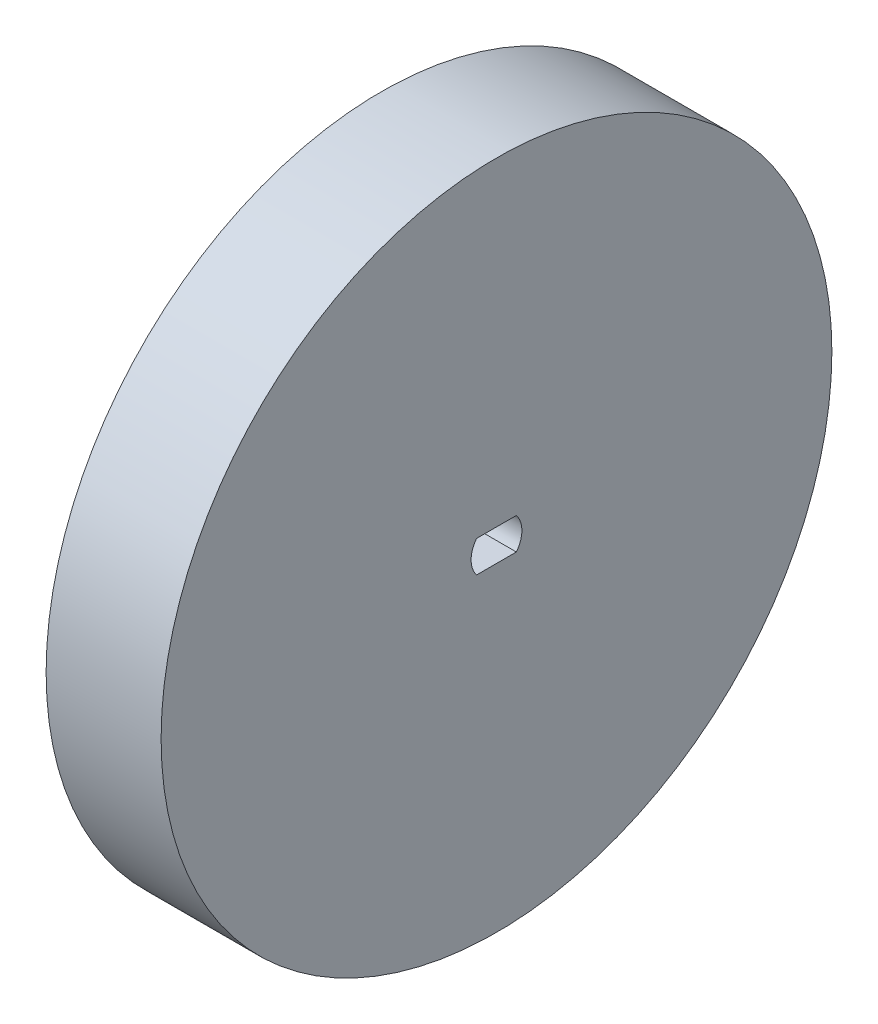
ISO-10303-21;
HEADER;
FILE_DESCRIPTION(('STEP AP214'),'2;1');
FILE_NAME('part.step','',(''),(''),'','','');
FILE_SCHEMA(('AUTOMOTIVE_DESIGN { 1 0 10303 214 1 1 1 1 }'));
ENDSEC;
DATA;
#1=APPLICATION_CONTEXT('core data for automotive mechanical design processes');
#2=APPLICATION_PROTOCOL_DEFINITION('international standard','automotive_design',2000,#1);
#3=PRODUCT_CONTEXT('',#1,'mechanical');
#4=PRODUCT('Part','Part','',(#3));
#5=PRODUCT_RELATED_PRODUCT_CATEGORY('part','',(#4));
#6=PRODUCT_DEFINITION_FORMATION('','',#4);
#7=PRODUCT_DEFINITION_CONTEXT('part definition',#1,'design');
#8=PRODUCT_DEFINITION('design','',#6,#7);
#9=PRODUCT_DEFINITION_SHAPE('','',#8);
#10=(LENGTH_UNIT() NAMED_UNIT(*) SI_UNIT(.MILLI.,.METRE.));
#11=(NAMED_UNIT(*) PLANE_ANGLE_UNIT() SI_UNIT($,.RADIAN.));
#12=(NAMED_UNIT(*) SI_UNIT($,.STERADIAN.) SOLID_ANGLE_UNIT());
#13=UNCERTAINTY_MEASURE_WITH_UNIT(LENGTH_MEASURE(1.E-05),#10,'distance_accuracy_value','');
#14=(GEOMETRIC_REPRESENTATION_CONTEXT(3) GLOBAL_UNCERTAINTY_ASSIGNED_CONTEXT((#13)) GLOBAL_UNIT_ASSIGNED_CONTEXT((#10,
#11,#12)) REPRESENTATION_CONTEXT('',''));
#15=CARTESIAN_POINT('',(0.,0.,0.));
#16=DIRECTION('',(0.,0.,1.));
#17=DIRECTION('',(1.,0.,0.));
#18=AXIS2_PLACEMENT_3D('',#15,#16,#17);
#19=CARTESIAN_POINT('',(-12.,0.,0.));
#20=DIRECTION('',(1.,0.,0.));
#21=DIRECTION('',(0.,0.,-1.));
#22=AXIS2_PLACEMENT_3D('',#19,#20,#21);
#23=CYLINDRICAL_SURFACE('',#22,2.65);
#24=CARTESIAN_POINT('',(0.,0.,0.));
#25=DIRECTION('',(1.,0.,0.));
#26=DIRECTION('',(0.,0.,-1.));
#27=AXIS2_PLACEMENT_3D('',#24,#25,#26);
#28=CIRCLE('',#27,2.65);
#29=CARTESIAN_POINT('',(0.,-1.65,-2.07364413533277));
#30=VERTEX_POINT('',#29);
#31=CARTESIAN_POINT('',(0.,1.65,-2.07364413533278));
#32=VERTEX_POINT('',#31);
#33=EDGE_CURVE('E104',#30,#32,#28,.T.);
#34=ORIENTED_EDGE('',*,*,#33,.T.);
#35=DIRECTION('',(1.,0.,0.));
#36=VECTOR('',#35,1.);
#37=CARTESIAN_POINT('',(-12.,1.65,-2.07364413533278));
#38=LINE('',#37,#36);
#39=CARTESIAN_POINT('',(-12.,1.65,-2.07364413533278));
#40=VERTEX_POINT('',#39);
#41=EDGE_CURVE('E11',#40,#32,#38,.T.);
#42=ORIENTED_EDGE('',*,*,#41,.F.);
#43=CARTESIAN_POINT('',(-12.,0.,0.));
#44=DIRECTION('',(1.,0.,0.));
#45=DIRECTION('',(0.,0.,-1.));
#46=AXIS2_PLACEMENT_3D('',#43,#44,#45);
#47=CIRCLE('',#46,2.65);
#48=CARTESIAN_POINT('',(-12.,-1.65,-2.07364413533277));
#49=VERTEX_POINT('',#48);
#50=EDGE_CURVE('E57',#49,#40,#47,.T.);
#51=ORIENTED_EDGE('',*,*,#50,.F.);
#52=DIRECTION('',(1.,0.,0.));
#53=VECTOR('',#52,1.);
#54=CARTESIAN_POINT('',(-12.,-1.65,-2.07364413533277));
#55=LINE('',#54,#53);
#56=EDGE_CURVE('E42',#49,#30,#55,.T.);
#57=ORIENTED_EDGE('',*,*,#56,.T.);
#58=EDGE_LOOP('',(#34,#42,#51,#57));
#59=FACE_BOUND('',#58,.T.);
#60=ADVANCED_FACE('F38',(#59),#23,.F.);
#61=CARTESIAN_POINT('',(-12.,1.65,0.));
#62=DIRECTION('',(0.,-1.,0.));
#63=DIRECTION('',(0.,0.,-1.));
#64=AXIS2_PLACEMENT_3D('',#61,#62,#63);
#65=PLANE('',#64);
#66=DIRECTION('',(0.,0.,-1.));
#67=VECTOR('',#66,1.);
#68=CARTESIAN_POINT('',(0.,1.65,0.));
#69=LINE('',#68,#67);
#70=CARTESIAN_POINT('',(0.,1.65,2.07364413533278));
#71=VERTEX_POINT('',#70);
#72=EDGE_CURVE('E108',#71,#32,#69,.T.);
#73=ORIENTED_EDGE('',*,*,#72,.F.);
#74=DIRECTION('',(1.,0.,0.));
#75=VECTOR('',#74,1.);
#76=CARTESIAN_POINT('',(-12.,1.65,2.07364413533278));
#77=LINE('',#76,#75);
#78=CARTESIAN_POINT('',(-12.,1.65,2.07364413533278));
#79=VERTEX_POINT('',#78);
#80=EDGE_CURVE('E48',#79,#71,#77,.T.);
#81=ORIENTED_EDGE('',*,*,#80,.F.);
#82=DIRECTION('',(0.,0.,-1.));
#83=VECTOR('',#82,1.);
#84=CARTESIAN_POINT('',(-12.,1.65,0.));
#85=LINE('',#84,#83);
#86=EDGE_CURVE('E88',#79,#40,#85,.T.);
#87=ORIENTED_EDGE('',*,*,#86,.T.);
#88=ORIENTED_EDGE('',*,*,#41,.T.);
#89=EDGE_LOOP('',(#73,#81,#87,#88));
#90=FACE_BOUND('',#89,.T.);
#91=ADVANCED_FACE('F129',(#90),#65,.T.);
#92=CARTESIAN_POINT('',(0.,-1.65,2.07364413533277));
#93=VERTEX_POINT('',#92);
#94=EDGE_CURVE('E93',#71,#93,#28,.T.);
#95=ORIENTED_EDGE('',*,*,#94,.T.);
#96=DIRECTION('',(1.,0.,0.));
#97=VECTOR('',#96,1.);
#98=CARTESIAN_POINT('',(-12.,-1.65,2.07364413533277));
#99=LINE('',#98,#97);
#100=CARTESIAN_POINT('',(-12.,-1.65,2.07364413533277));
#101=VERTEX_POINT('',#100);
#102=EDGE_CURVE('E91',#101,#93,#99,.T.);
#103=ORIENTED_EDGE('',*,*,#102,.F.);
#104=EDGE_CURVE('E84',#79,#101,#47,.T.);
#105=ORIENTED_EDGE('',*,*,#104,.F.);
#106=ORIENTED_EDGE('',*,*,#80,.T.);
#107=EDGE_LOOP('',(#95,#103,#105,#106));
#108=FACE_BOUND('',#107,.T.);
#109=ADVANCED_FACE('F92',(#108),#23,.F.);
#110=CARTESIAN_POINT('',(-12.,-1.65,0.));
#111=DIRECTION('',(0.,-1.,0.));
#112=DIRECTION('',(0.,0.,-1.));
#113=AXIS2_PLACEMENT_3D('',#110,#111,#112);
#114=PLANE('',#113);
#115=DIRECTION('',(0.,0.,-1.));
#116=VECTOR('',#115,1.);
#117=CARTESIAN_POINT('',(0.,-1.65,0.));
#118=LINE('',#117,#116);
#119=EDGE_CURVE('E106',#93,#30,#118,.T.);
#120=ORIENTED_EDGE('',*,*,#119,.T.);
#121=ORIENTED_EDGE('',*,*,#56,.F.);
#122=DIRECTION('',(0.,0.,-1.));
#123=VECTOR('',#122,1.);
#124=CARTESIAN_POINT('',(-12.,-1.65,0.));
#125=LINE('',#124,#123);
#126=EDGE_CURVE('E82',#101,#49,#125,.T.);
#127=ORIENTED_EDGE('',*,*,#126,.F.);
#128=ORIENTED_EDGE('',*,*,#102,.T.);
#129=EDGE_LOOP('',(#120,#121,#127,#128));
#130=FACE_BOUND('',#129,.T.);
#131=ADVANCED_FACE('F40',(#130),#114,.F.);
#132=CARTESIAN_POINT('',(-12.,0.,0.));
#133=DIRECTION('',(1.,0.,0.));
#134=DIRECTION('',(0.,0.,-1.));
#135=AXIS2_PLACEMENT_3D('',#132,#133,#134);
#136=CYLINDRICAL_SURFACE('',#135,35.);
#137=CARTESIAN_POINT('',(-12.,0.,0.));
#138=DIRECTION('',(1.,0.,0.));
#139=DIRECTION('',(0.,0.,-1.));
#140=AXIS2_PLACEMENT_3D('',#137,#138,#139);
#141=CIRCLE('',#140,35.);
#142=CARTESIAN_POINT('',(-12.,0.,-35.));
#143=VERTEX_POINT('',#142);
#144=EDGE_CURVE('E101',#143,#143,#141,.T.);
#145=ORIENTED_EDGE('',*,*,#144,.T.);
#146=EDGE_LOOP('',(#145));
#147=FACE_BOUND('',#146,.T.);
#148=CARTESIAN_POINT('',(0.,0.,0.));
#149=DIRECTION('',(1.,0.,0.));
#150=DIRECTION('',(0.,0.,-1.));
#151=AXIS2_PLACEMENT_3D('',#148,#149,#150);
#152=CIRCLE('',#151,35.);
#153=CARTESIAN_POINT('',(0.,0.,-35.));
#154=VERTEX_POINT('',#153);
#155=EDGE_CURVE('E98',#154,#154,#152,.T.);
#156=ORIENTED_EDGE('',*,*,#155,.F.);
#157=EDGE_LOOP('',(#156));
#158=FACE_BOUND('',#157,.T.);
#159=ADVANCED_FACE('F117',(#147,#158),#136,.T.);
#160=CARTESIAN_POINT('',(-12.,0.,0.));
#161=DIRECTION('',(1.,0.,0.));
#162=DIRECTION('',(0.,0.,-1.));
#163=AXIS2_PLACEMENT_3D('',#160,#161,#162);
#164=PLANE('',#163);
#165=ORIENTED_EDGE('',*,*,#50,.T.);
#166=ORIENTED_EDGE('',*,*,#86,.F.);
#167=ORIENTED_EDGE('',*,*,#104,.T.);
#168=ORIENTED_EDGE('',*,*,#126,.T.);
#169=EDGE_LOOP('',(#165,#166,#167,#168));
#170=FACE_BOUND('',#169,.T.);
#171=ORIENTED_EDGE('',*,*,#144,.F.);
#172=EDGE_LOOP('',(#171));
#173=FACE_BOUND('',#172,.T.);
#174=ADVANCED_FACE('F86',(#170,#173),#164,.F.);
#175=CARTESIAN_POINT('',(0.,0.,0.));
#176=DIRECTION('',(1.,0.,0.));
#177=DIRECTION('',(0.,0.,-1.));
#178=AXIS2_PLACEMENT_3D('',#175,#176,#177);
#179=PLANE('',#178);
#180=ORIENTED_EDGE('',*,*,#33,.F.);
#181=ORIENTED_EDGE('',*,*,#119,.F.);
#182=ORIENTED_EDGE('',*,*,#94,.F.);
#183=ORIENTED_EDGE('',*,*,#72,.T.);
#184=EDGE_LOOP('',(#180,#181,#182,#183));
#185=FACE_BOUND('',#184,.T.);
#186=ORIENTED_EDGE('',*,*,#155,.T.);
#187=EDGE_LOOP('',(#186));
#188=FACE_BOUND('',#187,.T.);
#189=ADVANCED_FACE('F115',(#185,#188),#179,.T.);
#190=CLOSED_SHELL('',(#60,#91,#109,#131,#159,#174,#189));
#191=MANIFOLD_SOLID_BREP('B2',#190);
#192=ADVANCED_BREP_SHAPE_REPRESENTATION('',(#18,#191),#14);
#193=SHAPE_DEFINITION_REPRESENTATION(#9,#192);
ENDSEC;
END-ISO-10303-21;
